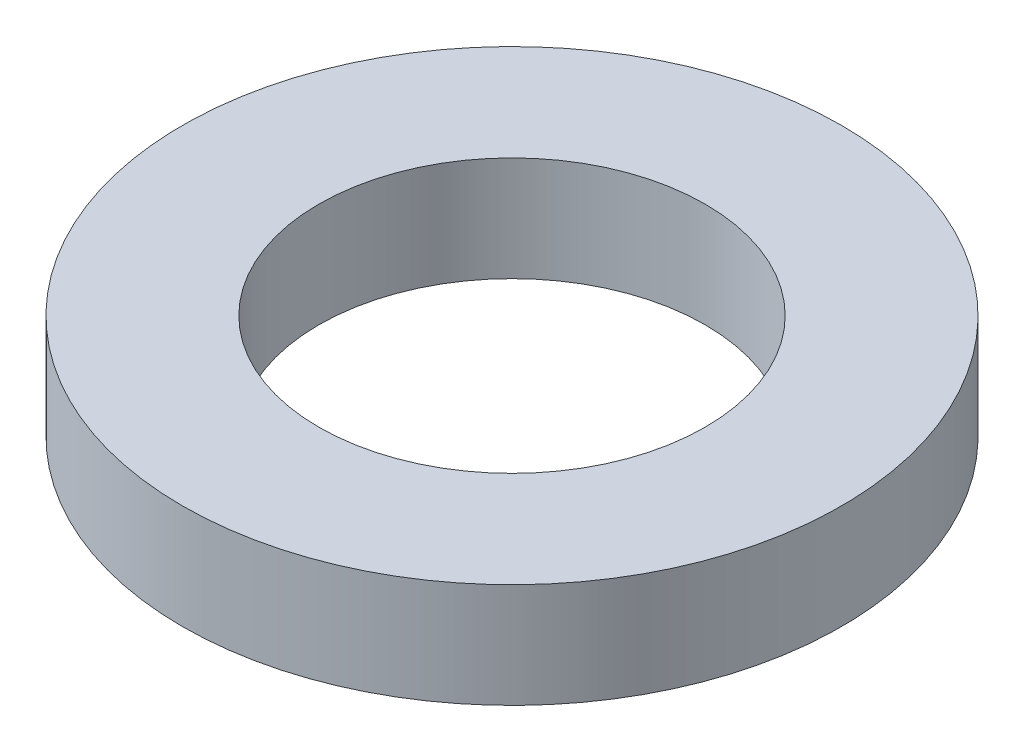
ISO-10303-21;
HEADER;
FILE_DESCRIPTION(('STEP AP214'),'2;1');
FILE_NAME('part.step','',(''),(''),'','','');
FILE_SCHEMA(('AUTOMOTIVE_DESIGN { 1 0 10303 214 1 1 1 1 }'));
ENDSEC;
DATA;
#1=APPLICATION_CONTEXT('core data for automotive mechanical design processes');
#2=APPLICATION_PROTOCOL_DEFINITION('international standard','automotive_design',2000,#1);
#3=PRODUCT_CONTEXT('',#1,'mechanical');
#4=PRODUCT('Part','Part','',(#3));
#5=PRODUCT_RELATED_PRODUCT_CATEGORY('part','',(#4));
#6=PRODUCT_DEFINITION_FORMATION('','',#4);
#7=PRODUCT_DEFINITION_CONTEXT('part definition',#1,'design');
#8=PRODUCT_DEFINITION('design','',#6,#7);
#9=PRODUCT_DEFINITION_SHAPE('','',#8);
#10=(LENGTH_UNIT() NAMED_UNIT(*) SI_UNIT(.MILLI.,.METRE.));
#11=(NAMED_UNIT(*) PLANE_ANGLE_UNIT() SI_UNIT($,.RADIAN.));
#12=(NAMED_UNIT(*) SI_UNIT($,.STERADIAN.) SOLID_ANGLE_UNIT());
#13=UNCERTAINTY_MEASURE_WITH_UNIT(LENGTH_MEASURE(1.E-05),#10,'distance_accuracy_value','');
#14=(GEOMETRIC_REPRESENTATION_CONTEXT(3) GLOBAL_UNCERTAINTY_ASSIGNED_CONTEXT((#13)) GLOBAL_UNIT_ASSIGNED_CONTEXT((#10,
#11,#12)) REPRESENTATION_CONTEXT('',''));
#15=CARTESIAN_POINT('',(0.,0.,0.));
#16=DIRECTION('',(0.,0.,1.));
#17=DIRECTION('',(1.,0.,0.));
#18=AXIS2_PLACEMENT_3D('',#15,#16,#17);
#19=CARTESIAN_POINT('',(0.,23.,0.));
#20=DIRECTION('',(0.,-1.,0.));
#21=DIRECTION('',(0.,0.,-1.));
#22=AXIS2_PLACEMENT_3D('',#19,#20,#21);
#23=CYLINDRICAL_SURFACE('',#22,72.5);
#24=CARTESIAN_POINT('',(0.,23.,0.));
#25=DIRECTION('',(0.,1.,0.));
#26=DIRECTION('',(0.,0.,1.));
#27=AXIS2_PLACEMENT_3D('',#24,#25,#26);
#28=CIRCLE('',#27,72.5);
#29=CARTESIAN_POINT('',(0.,23.,72.5));
#30=VERTEX_POINT('',#29);
#31=EDGE_CURVE('E10',#30,#30,#28,.T.);
#32=ORIENTED_EDGE('',*,*,#31,.F.);
#33=EDGE_LOOP('',(#32));
#34=FACE_BOUND('',#33,.T.);
#35=CARTESIAN_POINT('',(0.,0.,0.));
#36=DIRECTION('',(0.,1.,0.));
#37=DIRECTION('',(0.,0.,1.));
#38=AXIS2_PLACEMENT_3D('',#35,#36,#37);
#39=CIRCLE('',#38,72.5);
#40=CARTESIAN_POINT('',(0.,0.,72.5));
#41=VERTEX_POINT('',#40);
#42=EDGE_CURVE('E37',#41,#41,#39,.T.);
#43=ORIENTED_EDGE('',*,*,#42,.T.);
#44=EDGE_LOOP('',(#43));
#45=FACE_BOUND('',#44,.T.);
#46=ADVANCED_FACE('F40',(#34,#45),#23,.T.);
#47=CARTESIAN_POINT('',(0.,23.,0.));
#48=DIRECTION('',(0.,1.,0.));
#49=DIRECTION('',(0.,0.,1.));
#50=AXIS2_PLACEMENT_3D('',#47,#48,#49);
#51=PLANE('',#50);
#52=CARTESIAN_POINT('',(0.,23.,0.));
#53=DIRECTION('',(0.,1.,0.));
#54=DIRECTION('',(0.,0.,1.));
#55=AXIS2_PLACEMENT_3D('',#52,#53,#54);
#56=CIRCLE('',#55,42.5);
#57=CARTESIAN_POINT('',(0.,23.,42.5));
#58=VERTEX_POINT('',#57);
#59=EDGE_CURVE('E50',#58,#58,#56,.T.);
#60=ORIENTED_EDGE('',*,*,#59,.F.);
#61=EDGE_LOOP('',(#60));
#62=FACE_BOUND('',#61,.T.);
#63=ORIENTED_EDGE('',*,*,#31,.T.);
#64=EDGE_LOOP('',(#63));
#65=FACE_BOUND('',#64,.T.);
#66=ADVANCED_FACE('F59',(#62,#65),#51,.T.);
#67=CARTESIAN_POINT('',(0.,0.,0.));
#68=DIRECTION('',(0.,1.,0.));
#69=DIRECTION('',(0.,0.,1.));
#70=AXIS2_PLACEMENT_3D('',#67,#68,#69);
#71=PLANE('',#70);
#72=CARTESIAN_POINT('',(0.,0.,0.));
#73=DIRECTION('',(0.,1.,0.));
#74=DIRECTION('',(0.,0.,1.));
#75=AXIS2_PLACEMENT_3D('',#72,#73,#74);
#76=CIRCLE('',#75,42.5);
#77=CARTESIAN_POINT('',(0.,0.,42.5));
#78=VERTEX_POINT('',#77);
#79=EDGE_CURVE('E47',#78,#78,#76,.T.);
#80=ORIENTED_EDGE('',*,*,#79,.T.);
#81=EDGE_LOOP('',(#80));
#82=FACE_BOUND('',#81,.T.);
#83=ORIENTED_EDGE('',*,*,#42,.F.);
#84=EDGE_LOOP('',(#83));
#85=FACE_BOUND('',#84,.T.);
#86=ADVANCED_FACE('F58',(#82,#85),#71,.F.);
#87=CARTESIAN_POINT('',(0.,23.,0.));
#88=DIRECTION('',(0.,-1.,0.));
#89=DIRECTION('',(0.,0.,-1.));
#90=AXIS2_PLACEMENT_3D('',#87,#88,#89);
#91=CYLINDRICAL_SURFACE('',#90,42.5);
#92=ORIENTED_EDGE('',*,*,#59,.T.);
#93=EDGE_LOOP('',(#92));
#94=FACE_BOUND('',#93,.T.);
#95=ORIENTED_EDGE('',*,*,#79,.F.);
#96=EDGE_LOOP('',(#95));
#97=FACE_BOUND('',#96,.T.);
#98=ADVANCED_FACE('F54',(#94,#97),#91,.F.);
#99=CLOSED_SHELL('',(#46,#66,#86,#98));
#100=MANIFOLD_SOLID_BREP('B2',#99);
#101=ADVANCED_BREP_SHAPE_REPRESENTATION('',(#18,#100),#14);
#102=SHAPE_DEFINITION_REPRESENTATION(#9,#101);
ENDSEC;
END-ISO-10303-21;
